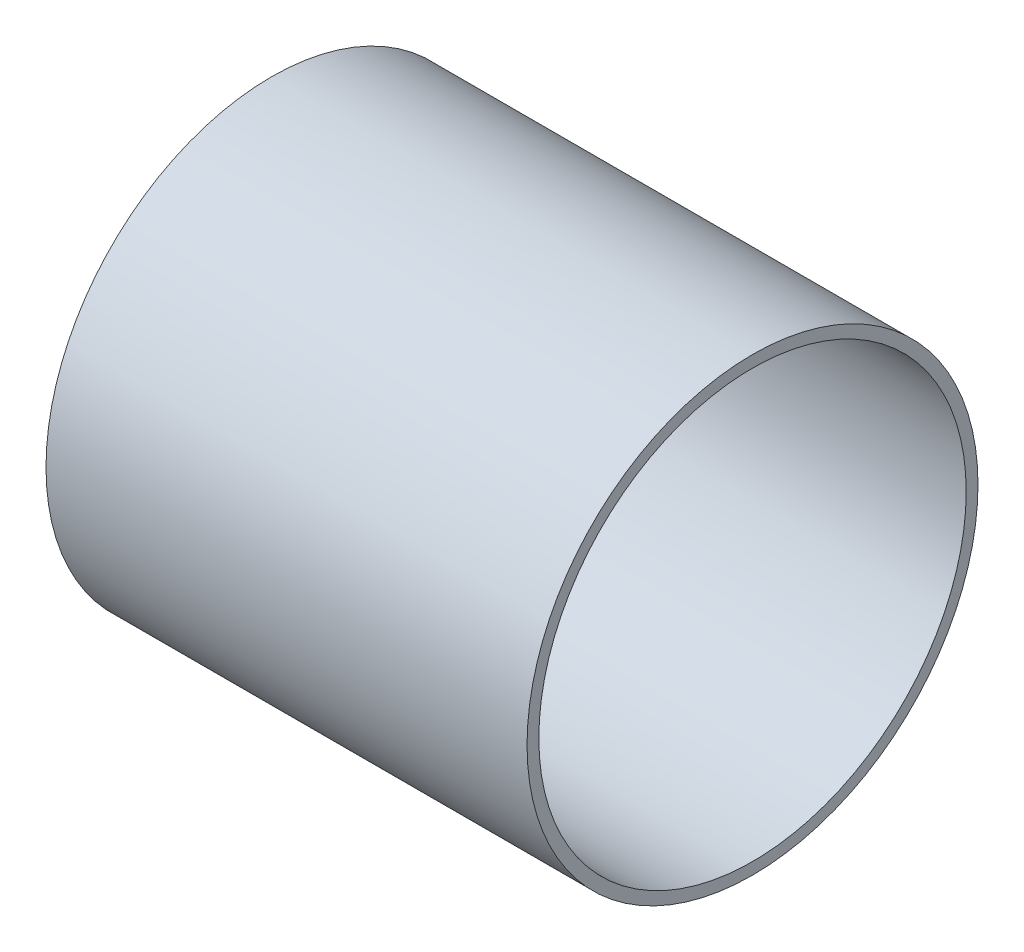
ISO-10303-21;
HEADER;
FILE_DESCRIPTION(('STEP AP214'),'2;1');
FILE_NAME('part.step','',(''),(''),'','','');
FILE_SCHEMA(('AUTOMOTIVE_DESIGN { 1 0 10303 214 1 1 1 1 }'));
ENDSEC;
DATA;
#1=APPLICATION_CONTEXT('core data for automotive mechanical design processes');
#2=APPLICATION_PROTOCOL_DEFINITION('international standard','automotive_design',2000,#1);
#3=PRODUCT_CONTEXT('',#1,'mechanical');
#4=PRODUCT('Part','Part','',(#3));
#5=PRODUCT_RELATED_PRODUCT_CATEGORY('part','',(#4));
#6=PRODUCT_DEFINITION_FORMATION('','',#4);
#7=PRODUCT_DEFINITION_CONTEXT('part definition',#1,'design');
#8=PRODUCT_DEFINITION('design','',#6,#7);
#9=PRODUCT_DEFINITION_SHAPE('','',#8);
#10=(LENGTH_UNIT() NAMED_UNIT(*) SI_UNIT(.MILLI.,.METRE.));
#11=(NAMED_UNIT(*) PLANE_ANGLE_UNIT() SI_UNIT($,.RADIAN.));
#12=(NAMED_UNIT(*) SI_UNIT($,.STERADIAN.) SOLID_ANGLE_UNIT());
#13=UNCERTAINTY_MEASURE_WITH_UNIT(LENGTH_MEASURE(1.E-05),#10,'distance_accuracy_value','');
#14=(GEOMETRIC_REPRESENTATION_CONTEXT(3) GLOBAL_UNCERTAINTY_ASSIGNED_CONTEXT((#13)) GLOBAL_UNIT_ASSIGNED_CONTEXT((#10,
#11,#12)) REPRESENTATION_CONTEXT('',''));
#15=CARTESIAN_POINT('',(0.,0.,0.));
#16=DIRECTION('',(0.,0.,1.));
#17=DIRECTION('',(1.,0.,0.));
#18=AXIS2_PLACEMENT_3D('',#15,#16,#17);
#19=CARTESIAN_POINT('',(50.8,23.8125,0.));
#20=DIRECTION('',(-1.,0.,0.));
#21=DIRECTION('',(0.,0.,1.));
#22=AXIS2_PLACEMENT_3D('',#19,#20,#21);
#23=CYLINDRICAL_SURFACE('',#22,23.8125);
#24=CARTESIAN_POINT('',(50.8,23.8125,0.));
#25=DIRECTION('',(-1.,0.,0.));
#26=DIRECTION('',(0.,0.,1.));
#27=AXIS2_PLACEMENT_3D('',#24,#25,#26);
#28=CIRCLE('',#27,23.8125);
#29=CARTESIAN_POINT('',(50.8,23.8125,23.8125));
#30=VERTEX_POINT('',#29);
#31=EDGE_CURVE('E10',#30,#30,#28,.T.);
#32=ORIENTED_EDGE('',*,*,#31,.T.);
#33=EDGE_LOOP('',(#32));
#34=FACE_BOUND('',#33,.T.);
#35=CARTESIAN_POINT('',(0.,23.8125,0.));
#36=DIRECTION('',(-1.,0.,0.));
#37=DIRECTION('',(0.,0.,1.));
#38=AXIS2_PLACEMENT_3D('',#35,#36,#37);
#39=CIRCLE('',#38,23.8125);
#40=CARTESIAN_POINT('',(0.,23.8125,23.8125));
#41=VERTEX_POINT('',#40);
#42=EDGE_CURVE('E35',#41,#41,#39,.T.);
#43=ORIENTED_EDGE('',*,*,#42,.F.);
#44=EDGE_LOOP('',(#43));
#45=FACE_BOUND('',#44,.T.);
#46=ADVANCED_FACE('F32',(#34,#45),#23,.T.);
#47=CARTESIAN_POINT('',(50.8,23.8125,0.));
#48=DIRECTION('',(-1.,0.,0.));
#49=DIRECTION('',(0.,0.,1.));
#50=AXIS2_PLACEMENT_3D('',#47,#48,#49);
#51=PLANE('',#50);
#52=CARTESIAN_POINT('',(50.8,23.8125,0.));
#53=DIRECTION('',(-1.,0.,0.));
#54=DIRECTION('',(0.,0.,1.));
#55=AXIS2_PLACEMENT_3D('',#52,#53,#54);
#56=CIRCLE('',#55,22.5679);
#57=CARTESIAN_POINT('',(50.8,23.8125,22.5679));
#58=VERTEX_POINT('',#57);
#59=EDGE_CURVE('E42',#58,#58,#56,.T.);
#60=ORIENTED_EDGE('',*,*,#59,.T.);
#61=EDGE_LOOP('',(#60));
#62=FACE_BOUND('',#61,.T.);
#63=ORIENTED_EDGE('',*,*,#31,.F.);
#64=EDGE_LOOP('',(#63));
#65=FACE_BOUND('',#64,.T.);
#66=ADVANCED_FACE('F50',(#62,#65),#51,.F.);
#67=CARTESIAN_POINT('',(0.,23.8125,0.));
#68=DIRECTION('',(-1.,0.,0.));
#69=DIRECTION('',(0.,0.,1.));
#70=AXIS2_PLACEMENT_3D('',#67,#68,#69);
#71=PLANE('',#70);
#72=CARTESIAN_POINT('',(0.,23.8125,0.));
#73=DIRECTION('',(-1.,0.,0.));
#74=DIRECTION('',(0.,0.,1.));
#75=AXIS2_PLACEMENT_3D('',#72,#73,#74);
#76=CIRCLE('',#75,22.5679);
#77=CARTESIAN_POINT('',(0.,23.8125,22.5679));
#78=VERTEX_POINT('',#77);
#79=EDGE_CURVE('E44',#78,#78,#76,.T.);
#80=ORIENTED_EDGE('',*,*,#79,.F.);
#81=EDGE_LOOP('',(#80));
#82=FACE_BOUND('',#81,.T.);
#83=ORIENTED_EDGE('',*,*,#42,.T.);
#84=EDGE_LOOP('',(#83));
#85=FACE_BOUND('',#84,.T.);
#86=ADVANCED_FACE('F56',(#82,#85),#71,.T.);
#87=CARTESIAN_POINT('',(50.8,23.8125,0.));
#88=DIRECTION('',(-1.,0.,0.));
#89=DIRECTION('',(0.,0.,1.));
#90=AXIS2_PLACEMENT_3D('',#87,#88,#89);
#91=CYLINDRICAL_SURFACE('',#90,22.5679);
#92=ORIENTED_EDGE('',*,*,#59,.F.);
#93=EDGE_LOOP('',(#92));
#94=FACE_BOUND('',#93,.T.);
#95=ORIENTED_EDGE('',*,*,#79,.T.);
#96=EDGE_LOOP('',(#95));
#97=FACE_BOUND('',#96,.T.);
#98=ADVANCED_FACE('F53',(#94,#97),#91,.F.);
#99=CLOSED_SHELL('',(#46,#66,#86,#98));
#100=MANIFOLD_SOLID_BREP('B2',#99);
#101=ADVANCED_BREP_SHAPE_REPRESENTATION('',(#18,#100),#14);
#102=SHAPE_DEFINITION_REPRESENTATION(#9,#101);
ENDSEC;
END-ISO-10303-21;
